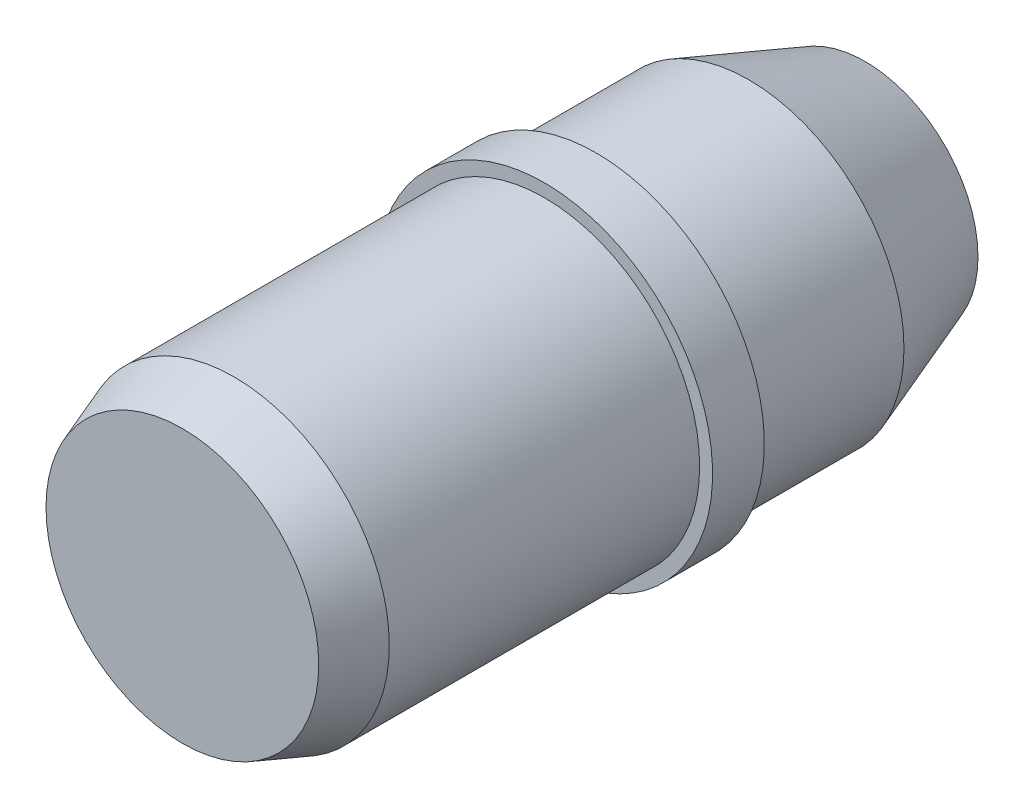
ISO-10303-21;
HEADER;
FILE_DESCRIPTION(('STEP AP214'),'2;1');
FILE_NAME('part.step','',(''),(''),'','','');
FILE_SCHEMA(('AUTOMOTIVE_DESIGN { 1 0 10303 214 1 1 1 1 }'));
ENDSEC;
DATA;
#1=APPLICATION_CONTEXT('core data for automotive mechanical design processes');
#2=APPLICATION_PROTOCOL_DEFINITION('international standard','automotive_design',2000,#1);
#3=PRODUCT_CONTEXT('',#1,'mechanical');
#4=PRODUCT('Part','Part','',(#3));
#5=PRODUCT_RELATED_PRODUCT_CATEGORY('part','',(#4));
#6=PRODUCT_DEFINITION_FORMATION('','',#4);
#7=PRODUCT_DEFINITION_CONTEXT('part definition',#1,'design');
#8=PRODUCT_DEFINITION('design','',#6,#7);
#9=PRODUCT_DEFINITION_SHAPE('','',#8);
#10=(LENGTH_UNIT() NAMED_UNIT(*) SI_UNIT(.MILLI.,.METRE.));
#11=(NAMED_UNIT(*) PLANE_ANGLE_UNIT() SI_UNIT($,.RADIAN.));
#12=(NAMED_UNIT(*) SI_UNIT($,.STERADIAN.) SOLID_ANGLE_UNIT());
#13=UNCERTAINTY_MEASURE_WITH_UNIT(LENGTH_MEASURE(1.E-05),#10,'distance_accuracy_value','');
#14=(GEOMETRIC_REPRESENTATION_CONTEXT(3) GLOBAL_UNCERTAINTY_ASSIGNED_CONTEXT((#13)) GLOBAL_UNIT_ASSIGNED_CONTEXT((#10,
#11,#12)) REPRESENTATION_CONTEXT('',''));
#15=CARTESIAN_POINT('',(0.,0.,0.));
#16=DIRECTION('',(0.,0.,1.));
#17=DIRECTION('',(1.,0.,0.));
#18=AXIS2_PLACEMENT_3D('',#15,#16,#17);
#19=CARTESIAN_POINT('',(0.,0.,7.));
#20=DIRECTION('',(0.,0.,-1.));
#21=DIRECTION('',(-1.,0.,0.));
#22=AXIS2_PLACEMENT_3D('',#19,#20,#21);
#23=CYLINDRICAL_SURFACE('',#22,3.);
#24=CARTESIAN_POINT('',(0.,0.,5.99999999999999));
#25=DIRECTION('',(0.,0.,1.));
#26=DIRECTION('',(1.,0.,0.));
#27=AXIS2_PLACEMENT_3D('',#24,#25,#26);
#28=CIRCLE('',#27,3.);
#29=CARTESIAN_POINT('',(3.,0.,5.99999999999999));
#30=VERTEX_POINT('',#29);
#31=EDGE_CURVE('E42',#30,#30,#28,.F.);
#32=ORIENTED_EDGE('',*,*,#31,.T.);
#33=EDGE_LOOP('',(#32));
#34=FACE_BOUND('',#33,.T.);
#35=CARTESIAN_POINT('',(0.,0.,0.));
#36=DIRECTION('',(0.,0.,-1.));
#37=DIRECTION('',(-1.,0.,0.));
#38=AXIS2_PLACEMENT_3D('',#35,#36,#37);
#39=CIRCLE('',#38,3.);
#40=CARTESIAN_POINT('',(-3.,0.,0.));
#41=VERTEX_POINT('',#40);
#42=EDGE_CURVE('E51',#41,#41,#39,.T.);
#43=ORIENTED_EDGE('',*,*,#42,.F.);
#44=EDGE_LOOP('',(#43));
#45=FACE_BOUND('',#44,.T.);
#46=ADVANCED_FACE('F31',(#34,#45),#23,.T.);
#47=CARTESIAN_POINT('',(0.,0.,7.));
#48=DIRECTION('',(0.,0.,1.));
#49=DIRECTION('',(1.,0.,0.));
#50=AXIS2_PLACEMENT_3D('',#47,#48,#49);
#51=PLANE('',#50);
#52=CARTESIAN_POINT('',(0.,0.,7.));
#53=DIRECTION('',(0.,0.,1.));
#54=DIRECTION('',(1.,0.,0.));
#55=AXIS2_PLACEMENT_3D('',#52,#53,#54);
#56=CIRCLE('',#55,2.6360297657338);
#57=CARTESIAN_POINT('',(2.6360297657338,0.,7.));
#58=VERTEX_POINT('',#57);
#59=EDGE_CURVE('E46',#58,#58,#56,.T.);
#60=ORIENTED_EDGE('',*,*,#59,.T.);
#61=EDGE_LOOP('',(#60));
#62=FACE_BOUND('',#61,.T.);
#63=ADVANCED_FACE('F89',(#62),#51,.T.);
#64=CARTESIAN_POINT('',(0.,0.,7.));
#65=DIRECTION('',(0.,0.,-1.));
#66=DIRECTION('',(-1.,0.,0.));
#67=AXIS2_PLACEMENT_3D('',#64,#65,#66);
#68=CONICAL_SURFACE('',#67,2.6360297657338,0.349065850398863);
#69=ORIENTED_EDGE('',*,*,#31,.F.);
#70=EDGE_LOOP('',(#69));
#71=FACE_BOUND('',#70,.T.);
#72=ORIENTED_EDGE('',*,*,#59,.F.);
#73=EDGE_LOOP('',(#72));
#74=FACE_BOUND('',#73,.T.);
#75=ADVANCED_FACE('F76',(#71,#74),#68,.T.);
#76=CARTESIAN_POINT('',(0.,0.,-1.));
#77=DIRECTION('',(0.,0.,1.));
#78=DIRECTION('',(1.,0.,0.));
#79=AXIS2_PLACEMENT_3D('',#76,#77,#78);
#80=CYLINDRICAL_SURFACE('',#79,3.25);
#81=CARTESIAN_POINT('',(0.,0.,-1.));
#82=DIRECTION('',(0.,0.,-1.));
#83=DIRECTION('',(-1.,0.,0.));
#84=AXIS2_PLACEMENT_3D('',#81,#82,#83);
#85=CIRCLE('',#84,3.25);
#86=CARTESIAN_POINT('',(-3.25,0.,-1.));
#87=VERTEX_POINT('',#86);
#88=EDGE_CURVE('E54',#87,#87,#85,.T.);
#89=ORIENTED_EDGE('',*,*,#88,.F.);
#90=EDGE_LOOP('',(#89));
#91=FACE_BOUND('',#90,.T.);
#92=CARTESIAN_POINT('',(0.,0.,0.));
#93=DIRECTION('',(0.,0.,-1.));
#94=DIRECTION('',(-1.,0.,0.));
#95=AXIS2_PLACEMENT_3D('',#92,#93,#94);
#96=CIRCLE('',#95,3.25);
#97=CARTESIAN_POINT('',(-3.25,0.,0.));
#98=VERTEX_POINT('',#97);
#99=EDGE_CURVE('E55',#98,#98,#96,.T.);
#100=ORIENTED_EDGE('',*,*,#99,.T.);
#101=EDGE_LOOP('',(#100));
#102=FACE_BOUND('',#101,.T.);
#103=ADVANCED_FACE('F70',(#91,#102),#80,.T.);
#104=CARTESIAN_POINT('',(0.,0.,-1.));
#105=DIRECTION('',(0.,0.,-1.));
#106=DIRECTION('',(-1.,0.,0.));
#107=AXIS2_PLACEMENT_3D('',#104,#105,#106);
#108=PLANE('',#107);
#109=CARTESIAN_POINT('',(0.,0.,-1.));
#110=DIRECTION('',(0.,0.,-1.));
#111=DIRECTION('',(-1.,0.,0.));
#112=AXIS2_PLACEMENT_3D('',#109,#110,#111);
#113=CIRCLE('',#112,3.);
#114=CARTESIAN_POINT('',(-3.,0.,-1.));
#115=VERTEX_POINT('',#114);
#116=EDGE_CURVE('E58',#115,#115,#113,.T.);
#117=ORIENTED_EDGE('',*,*,#116,.F.);
#118=EDGE_LOOP('',(#117));
#119=FACE_BOUND('',#118,.T.);
#120=ORIENTED_EDGE('',*,*,#88,.T.);
#121=EDGE_LOOP('',(#120));
#122=FACE_BOUND('',#121,.T.);
#123=ADVANCED_FACE('F66',(#119,#122),#108,.T.);
#124=CARTESIAN_POINT('',(0.,0.,0.));
#125=DIRECTION('',(0.,0.,-1.));
#126=DIRECTION('',(-1.,0.,0.));
#127=AXIS2_PLACEMENT_3D('',#124,#125,#126);
#128=PLANE('',#127);
#129=ORIENTED_EDGE('',*,*,#42,.T.);
#130=EDGE_LOOP('',(#129));
#131=FACE_BOUND('',#130,.T.);
#132=ORIENTED_EDGE('',*,*,#99,.F.);
#133=EDGE_LOOP('',(#132));
#134=FACE_BOUND('',#133,.T.);
#135=ADVANCED_FACE('F69',(#131,#134),#128,.F.);
#136=CARTESIAN_POINT('',(0.,0.,-6.2));
#137=DIRECTION('',(0.,0.,1.));
#138=DIRECTION('',(1.,0.,0.));
#139=AXIS2_PLACEMENT_3D('',#136,#137,#138);
#140=CYLINDRICAL_SURFACE('',#139,3.);
#141=CARTESIAN_POINT('',(0.,0.,-3.94999999999997));
#142=DIRECTION('',(0.,0.,-1.));
#143=DIRECTION('',(-1.,0.,0.));
#144=AXIS2_PLACEMENT_3D('',#141,#142,#143);
#145=CIRCLE('',#144,3.);
#146=CARTESIAN_POINT('',(-3.,0.,-3.94999999999997));
#147=VERTEX_POINT('',#146);
#148=EDGE_CURVE('E10',#147,#147,#145,.F.);
#149=ORIENTED_EDGE('',*,*,#148,.T.);
#150=EDGE_LOOP('',(#149));
#151=FACE_BOUND('',#150,.T.);
#152=ORIENTED_EDGE('',*,*,#116,.T.);
#153=EDGE_LOOP('',(#152));
#154=FACE_BOUND('',#153,.T.);
#155=ADVANCED_FACE('F64',(#151,#154),#140,.T.);
#156=CARTESIAN_POINT('',(0.,0.,-6.2));
#157=DIRECTION('',(0.,0.,-1.));
#158=DIRECTION('',(-1.,0.,0.));
#159=AXIS2_PLACEMENT_3D('',#156,#157,#158);
#160=PLANE('',#159);
#161=CARTESIAN_POINT('',(0.,0.,-6.2));
#162=DIRECTION('',(0.,0.,-1.));
#163=DIRECTION('',(-1.,0.,0.));
#164=AXIS2_PLACEMENT_3D('',#161,#162,#163);
#165=CIRCLE('',#164,2.18106697290104);
#166=CARTESIAN_POINT('',(-2.18106697290104,0.,-6.2));
#167=VERTEX_POINT('',#166);
#168=EDGE_CURVE('E38',#167,#167,#165,.T.);
#169=ORIENTED_EDGE('',*,*,#168,.T.);
#170=EDGE_LOOP('',(#169));
#171=FACE_BOUND('',#170,.T.);
#172=ADVANCED_FACE('F86',(#171),#160,.T.);
#173=CARTESIAN_POINT('',(0.,0.,-6.2));
#174=DIRECTION('',(0.,0.,1.));
#175=DIRECTION('',(1.,0.,0.));
#176=AXIS2_PLACEMENT_3D('',#173,#174,#175);
#177=CONICAL_SURFACE('',#176,2.18106697290104,0.349065850398863);
#178=ORIENTED_EDGE('',*,*,#148,.F.);
#179=EDGE_LOOP('',(#178));
#180=FACE_BOUND('',#179,.T.);
#181=ORIENTED_EDGE('',*,*,#168,.F.);
#182=EDGE_LOOP('',(#181));
#183=FACE_BOUND('',#182,.T.);
#184=ADVANCED_FACE('F33',(#180,#183),#177,.T.);
#185=CLOSED_SHELL('',(#46,#63,#75,#103,#123,#135,#155,#172,#184));
#186=MANIFOLD_SOLID_BREP('B2',#185);
#187=ADVANCED_BREP_SHAPE_REPRESENTATION('',(#18,#186),#14);
#188=SHAPE_DEFINITION_REPRESENTATION(#9,#187);
ENDSEC;
END-ISO-10303-21;
